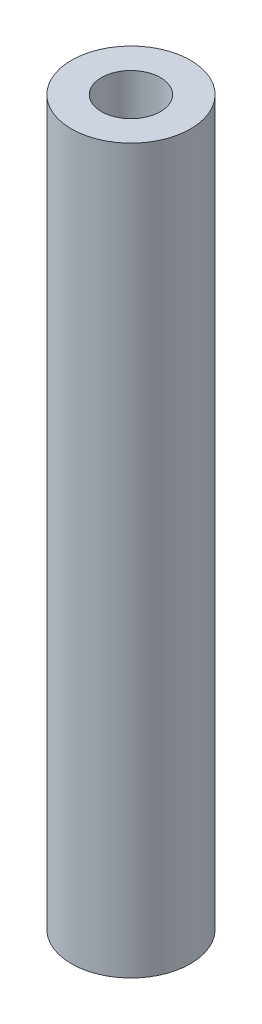
ISO-10303-21;
HEADER;
FILE_DESCRIPTION(('STEP AP214'),'2;1');
FILE_NAME('part.step','',(''),(''),'','','');
FILE_SCHEMA(('AUTOMOTIVE_DESIGN { 1 0 10303 214 1 1 1 1 }'));
ENDSEC;
DATA;
#1=APPLICATION_CONTEXT('core data for automotive mechanical design processes');
#2=APPLICATION_PROTOCOL_DEFINITION('international standard','automotive_design',2000,#1);
#3=PRODUCT_CONTEXT('',#1,'mechanical');
#4=PRODUCT('Part','Part','',(#3));
#5=PRODUCT_RELATED_PRODUCT_CATEGORY('part','',(#4));
#6=PRODUCT_DEFINITION_FORMATION('','',#4);
#7=PRODUCT_DEFINITION_CONTEXT('part definition',#1,'design');
#8=PRODUCT_DEFINITION('design','',#6,#7);
#9=PRODUCT_DEFINITION_SHAPE('','',#8);
#10=(LENGTH_UNIT() NAMED_UNIT(*) SI_UNIT(.MILLI.,.METRE.));
#11=(NAMED_UNIT(*) PLANE_ANGLE_UNIT() SI_UNIT($,.RADIAN.));
#12=(NAMED_UNIT(*) SI_UNIT($,.STERADIAN.) SOLID_ANGLE_UNIT());
#13=UNCERTAINTY_MEASURE_WITH_UNIT(LENGTH_MEASURE(1.E-05),#10,'distance_accuracy_value','');
#14=(GEOMETRIC_REPRESENTATION_CONTEXT(3) GLOBAL_UNCERTAINTY_ASSIGNED_CONTEXT((#13)) GLOBAL_UNIT_ASSIGNED_CONTEXT((#10,
#11,#12)) REPRESENTATION_CONTEXT('',''));
#15=CARTESIAN_POINT('',(0.,0.,0.));
#16=DIRECTION('',(0.,0.,1.));
#17=DIRECTION('',(1.,0.,0.));
#18=AXIS2_PLACEMENT_3D('',#15,#16,#17);
#19=CARTESIAN_POINT('',(0.,309.88,0.));
#20=DIRECTION('',(0.,1.,0.));
#21=DIRECTION('',(0.,0.,1.));
#22=AXIS2_PLACEMENT_3D('',#19,#20,#21);
#23=PLANE('',#22);
#24=CARTESIAN_POINT('',(0.,309.88,0.));
#25=DIRECTION('',(0.,1.,0.));
#26=DIRECTION('',(0.,0.,1.));
#27=AXIS2_PLACEMENT_3D('',#24,#25,#26);
#28=CIRCLE('',#27,25.5083112087525);
#29=CARTESIAN_POINT('',(0.,309.88,25.5083112087525));
#30=VERTEX_POINT('',#29);
#31=EDGE_CURVE('E10',#30,#30,#28,.T.);
#32=ORIENTED_EDGE('',*,*,#31,.T.);
#33=EDGE_LOOP('',(#32));
#34=FACE_BOUND('',#33,.T.);
#35=CARTESIAN_POINT('',(0.,309.88,0.));
#36=DIRECTION('',(0.,1.,0.));
#37=DIRECTION('',(0.,0.,1.));
#38=AXIS2_PLACEMENT_3D('',#35,#36,#37);
#39=CIRCLE('',#38,12.6517694351809);
#40=CARTESIAN_POINT('',(0.,309.88,12.6517694351809));
#41=VERTEX_POINT('',#40);
#42=EDGE_CURVE('E50',#41,#41,#39,.T.);
#43=ORIENTED_EDGE('',*,*,#42,.F.);
#44=EDGE_LOOP('',(#43));
#45=FACE_BOUND('',#44,.T.);
#46=ADVANCED_FACE('F37',(#34,#45),#23,.T.);
#47=CARTESIAN_POINT('',(0.,0.,0.));
#48=DIRECTION('',(0.,1.,0.));
#49=DIRECTION('',(0.,0.,1.));
#50=AXIS2_PLACEMENT_3D('',#47,#48,#49);
#51=PLANE('',#50);
#52=CARTESIAN_POINT('',(0.,0.,0.));
#53=DIRECTION('',(0.,1.,0.));
#54=DIRECTION('',(0.,0.,1.));
#55=AXIS2_PLACEMENT_3D('',#52,#53,#54);
#56=CIRCLE('',#55,25.5083112087525);
#57=CARTESIAN_POINT('',(0.,0.,25.5083112087525));
#58=VERTEX_POINT('',#57);
#59=EDGE_CURVE('E41',#58,#58,#56,.T.);
#60=ORIENTED_EDGE('',*,*,#59,.F.);
#61=EDGE_LOOP('',(#60));
#62=FACE_BOUND('',#61,.T.);
#63=CARTESIAN_POINT('',(0.,0.,0.));
#64=DIRECTION('',(0.,1.,0.));
#65=DIRECTION('',(0.,0.,1.));
#66=AXIS2_PLACEMENT_3D('',#63,#64,#65);
#67=CIRCLE('',#66,12.6517694351809);
#68=CARTESIAN_POINT('',(0.,0.,12.6517694351809));
#69=VERTEX_POINT('',#68);
#70=EDGE_CURVE('E52',#69,#69,#67,.T.);
#71=ORIENTED_EDGE('',*,*,#70,.T.);
#72=EDGE_LOOP('',(#71));
#73=FACE_BOUND('',#72,.T.);
#74=ADVANCED_FACE('F64',(#62,#73),#51,.F.);
#75=CARTESIAN_POINT('',(0.,309.88,0.));
#76=DIRECTION('',(0.,-1.,0.));
#77=DIRECTION('',(0.,0.,-1.));
#78=AXIS2_PLACEMENT_3D('',#75,#76,#77);
#79=CYLINDRICAL_SURFACE('',#78,25.5083112087525);
#80=ORIENTED_EDGE('',*,*,#31,.F.);
#81=EDGE_LOOP('',(#80));
#82=FACE_BOUND('',#81,.T.);
#83=ORIENTED_EDGE('',*,*,#59,.T.);
#84=EDGE_LOOP('',(#83));
#85=FACE_BOUND('',#84,.T.);
#86=ADVANCED_FACE('F39',(#82,#85),#79,.T.);
#87=CARTESIAN_POINT('',(0.,309.88,0.));
#88=DIRECTION('',(0.,-1.,0.));
#89=DIRECTION('',(0.,0.,-1.));
#90=AXIS2_PLACEMENT_3D('',#87,#88,#89);
#91=CYLINDRICAL_SURFACE('',#90,12.6517694351809);
#92=ORIENTED_EDGE('',*,*,#42,.T.);
#93=EDGE_LOOP('',(#92));
#94=FACE_BOUND('',#93,.T.);
#95=ORIENTED_EDGE('',*,*,#70,.F.);
#96=EDGE_LOOP('',(#95));
#97=FACE_BOUND('',#96,.T.);
#98=ADVANCED_FACE('F60',(#94,#97),#91,.F.);
#99=CLOSED_SHELL('',(#46,#74,#86,#98));
#100=MANIFOLD_SOLID_BREP('B2',#99);
#101=ADVANCED_BREP_SHAPE_REPRESENTATION('',(#18,#100),#14);
#102=SHAPE_DEFINITION_REPRESENTATION(#9,#101);
ENDSEC;
END-ISO-10303-21;
